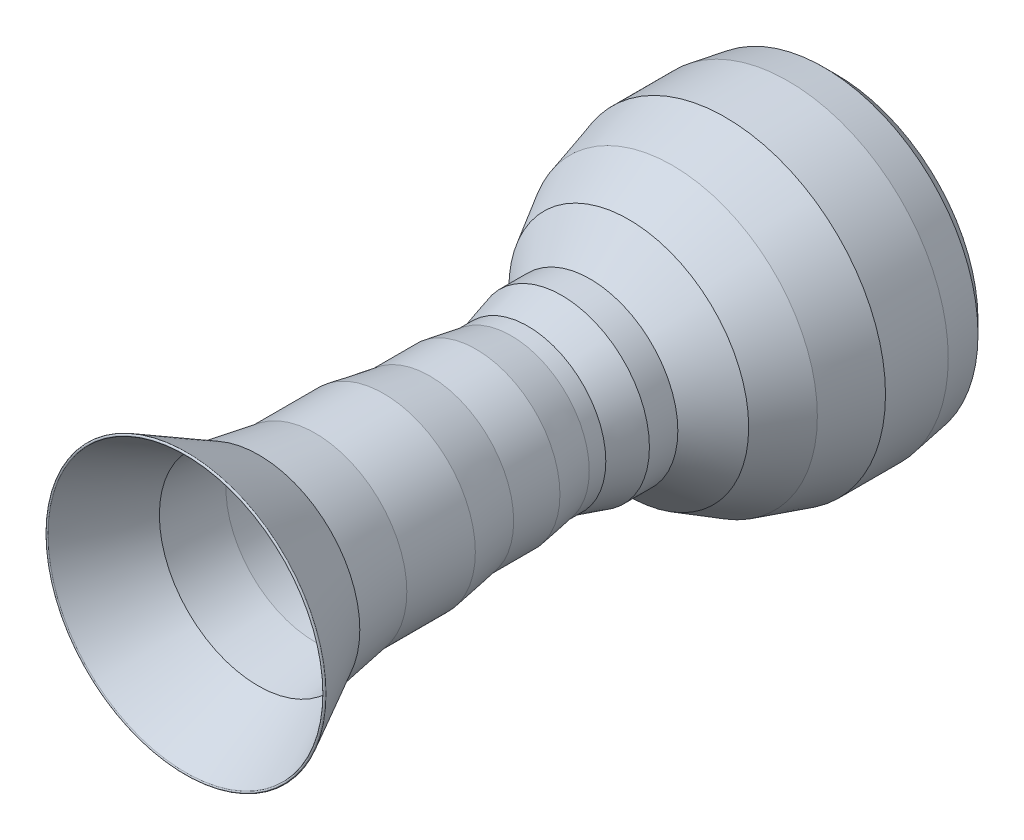
ISO-10303-21;
HEADER;
FILE_DESCRIPTION(('STEP AP214'),'2;1');
FILE_NAME('part.step','',(''),(''),'','','');
FILE_SCHEMA(('AUTOMOTIVE_DESIGN { 1 0 10303 214 1 1 1 1 }'));
ENDSEC;
DATA;
#1=APPLICATION_CONTEXT('core data for automotive mechanical design processes');
#2=APPLICATION_PROTOCOL_DEFINITION('international standard','automotive_design',2000,#1);
#3=PRODUCT_CONTEXT('',#1,'mechanical');
#4=PRODUCT('Part','Part','',(#3));
#5=PRODUCT_RELATED_PRODUCT_CATEGORY('part','',(#4));
#6=PRODUCT_DEFINITION_FORMATION('','',#4);
#7=PRODUCT_DEFINITION_CONTEXT('part definition',#1,'design');
#8=PRODUCT_DEFINITION('design','',#6,#7);
#9=PRODUCT_DEFINITION_SHAPE('','',#8);
#10=(LENGTH_UNIT() NAMED_UNIT(*) SI_UNIT(.MILLI.,.METRE.));
#11=(NAMED_UNIT(*) PLANE_ANGLE_UNIT() SI_UNIT($,.RADIAN.));
#12=(NAMED_UNIT(*) SI_UNIT($,.STERADIAN.) SOLID_ANGLE_UNIT());
#13=UNCERTAINTY_MEASURE_WITH_UNIT(LENGTH_MEASURE(1.E-05),#10,'distance_accuracy_value','');
#14=(GEOMETRIC_REPRESENTATION_CONTEXT(3) GLOBAL_UNCERTAINTY_ASSIGNED_CONTEXT((#13)) GLOBAL_UNIT_ASSIGNED_CONTEXT((#10,
#11,#12)) REPRESENTATION_CONTEXT('',''));
#15=CARTESIAN_POINT('',(0.,0.,0.));
#16=DIRECTION('',(0.,0.,1.));
#17=DIRECTION('',(1.,0.,0.));
#18=AXIS2_PLACEMENT_3D('',#15,#16,#17);
#19=CARTESIAN_POINT('',(0.,0.,-1242.65130735075));
#20=DIRECTION('',(0.,0.,1.));
#21=DIRECTION('',(1.,0.,0.));
#22=AXIS2_PLACEMENT_3D('',#19,#20,#21);
#23=TOROIDAL_SURFACE('',#22,598.951714386417,4.99999999999999);
#24=CARTESIAN_POINT('',(0.,0.,-1240.30050704522));
#25=DIRECTION('',(0.,0.,1.));
#26=DIRECTION('',(1.,0.,0.));
#27=AXIS2_PLACEMENT_3D('',#24,#25,#26);
#28=CIRCLE('',#27,594.538808549723);
#29=CARTESIAN_POINT('',(594.538808549723,0.,-1240.30050704522));
#30=VERTEX_POINT('',#29);
#31=EDGE_CURVE('E141',#30,#30,#28,.T.);
#32=ORIENTED_EDGE('',*,*,#31,.F.);
#33=EDGE_LOOP('',(#32));
#34=FACE_BOUND('',#33,.T.);
#35=CARTESIAN_POINT('',(0.,0.,-1245.00210765627));
#36=DIRECTION('',(0.,0.,1.));
#37=DIRECTION('',(1.,0.,0.));
#38=AXIS2_PLACEMENT_3D('',#35,#36,#37);
#39=CIRCLE('',#38,603.364620223111);
#40=CARTESIAN_POINT('',(603.364620223111,0.,-1245.00210765627));
#41=VERTEX_POINT('',#40);
#42=EDGE_CURVE('E10',#41,#41,#39,.T.);
#43=ORIENTED_EDGE('',*,*,#42,.T.);
#44=EDGE_LOOP('',(#43));
#45=FACE_BOUND('',#44,.T.);
#46=ADVANCED_FACE('F35',(#34,#45),#23,.T.);
#47=CARTESIAN_POINT('',(0.,0.,-1557.65293964381));
#48=DIRECTION('',(0.,0.,1.));
#49=DIRECTION('',(1.,0.,0.));
#50=AXIS2_PLACEMENT_3D('',#47,#48,#49);
#51=CONICAL_SURFACE('',#50,436.812307855919,0.48947212493324);
#52=ORIENTED_EDGE('',*,*,#42,.F.);
#53=EDGE_LOOP('',(#52));
#54=FACE_BOUND('',#53,.T.);
#55=CARTESIAN_POINT('',(0.,0.,-1557.65293964381));
#56=DIRECTION('',(0.,0.,1.));
#57=DIRECTION('',(1.,0.,0.));
#58=AXIS2_PLACEMENT_3D('',#55,#56,#57);
#59=CIRCLE('',#58,436.812307855919);
#60=CARTESIAN_POINT('',(436.812307855919,0.,-1557.65293964381));
#61=VERTEX_POINT('',#60);
#62=EDGE_CURVE('E41',#61,#61,#59,.T.);
#63=ORIENTED_EDGE('',*,*,#62,.T.);
#64=EDGE_LOOP('',(#63));
#65=FACE_BOUND('',#64,.T.);
#66=ADVANCED_FACE('F148',(#54,#65),#51,.T.);
#67=CARTESIAN_POINT('',(0.,0.,-1801.80188384453));
#68=DIRECTION('',(0.,0.,1.));
#69=DIRECTION('',(1.,0.,0.));
#70=AXIS2_PLACEMENT_3D('',#67,#68,#69);
#71=CONICAL_SURFACE('',#70,396.120817155799,0.165148677414626);
#72=ORIENTED_EDGE('',*,*,#62,.F.);
#73=EDGE_LOOP('',(#72));
#74=FACE_BOUND('',#73,.T.);
#75=CARTESIAN_POINT('',(0.,0.,-1801.80188384453));
#76=DIRECTION('',(0.,0.,1.));
#77=DIRECTION('',(1.,0.,0.));
#78=AXIS2_PLACEMENT_3D('',#75,#76,#77);
#79=CIRCLE('',#78,396.120817155799);
#80=CARTESIAN_POINT('',(396.120817155799,0.,-1801.80188384453));
#81=VERTEX_POINT('',#80);
#82=EDGE_CURVE('E45',#81,#81,#79,.T.);
#83=ORIENTED_EDGE('',*,*,#82,.T.);
#84=EDGE_LOOP('',(#83));
#85=FACE_BOUND('',#84,.T.);
#86=ADVANCED_FACE('F152',(#74,#85),#71,.T.);
#87=CARTESIAN_POINT('',(0.,0.,0.));
#88=DIRECTION('',(0.,0.,1.));
#89=DIRECTION('',(1.,0.,0.));
#90=AXIS2_PLACEMENT_3D('',#87,#88,#89);
#91=CYLINDRICAL_SURFACE('',#90,396.120817155799);
#92=ORIENTED_EDGE('',*,*,#82,.F.);
#93=EDGE_LOOP('',(#92));
#94=FACE_BOUND('',#93,.T.);
#95=CARTESIAN_POINT('',(0.,0.,-2098.28381526406));
#96=DIRECTION('',(0.,0.,1.));
#97=DIRECTION('',(1.,0.,0.));
#98=AXIS2_PLACEMENT_3D('',#95,#96,#97);
#99=CIRCLE('',#98,396.120817155799);
#100=CARTESIAN_POINT('',(396.120817155799,0.,-2098.28381526406));
#101=VERTEX_POINT('',#100);
#102=EDGE_CURVE('E49',#101,#101,#99,.T.);
#103=ORIENTED_EDGE('',*,*,#102,.T.);
#104=EDGE_LOOP('',(#103));
#105=FACE_BOUND('',#104,.T.);
#106=ADVANCED_FACE('F157',(#94,#105),#91,.T.);
#107=CARTESIAN_POINT('',(0.,0.,-2297.26071759217));
#108=DIRECTION('',(0.,0.,1.));
#109=DIRECTION('',(1.,0.,0.));
#110=AXIS2_PLACEMENT_3D('',#107,#108,#109);
#111=CONICAL_SURFACE('',#110,362.958000101113,0.165148677414626);
#112=ORIENTED_EDGE('',*,*,#102,.F.);
#113=EDGE_LOOP('',(#112));
#114=FACE_BOUND('',#113,.T.);
#115=CARTESIAN_POINT('',(0.,0.,-2297.26071759217));
#116=DIRECTION('',(0.,0.,1.));
#117=DIRECTION('',(1.,0.,0.));
#118=AXIS2_PLACEMENT_3D('',#115,#116,#117);
#119=CIRCLE('',#118,362.958000101113);
#120=CARTESIAN_POINT('',(362.958000101113,0.,-2297.26071759217));
#121=VERTEX_POINT('',#120);
#122=EDGE_CURVE('E54',#121,#121,#119,.T.);
#123=ORIENTED_EDGE('',*,*,#122,.T.);
#124=EDGE_LOOP('',(#123));
#125=FACE_BOUND('',#124,.T.);
#126=ADVANCED_FACE('F163',(#114,#125),#111,.T.);
#127=CARTESIAN_POINT('',(0.,0.,0.));
#128=DIRECTION('',(0.,0.,1.));
#129=DIRECTION('',(1.,0.,0.));
#130=AXIS2_PLACEMENT_3D('',#127,#128,#129);
#131=CYLINDRICAL_SURFACE('',#130,362.958000101113);
#132=ORIENTED_EDGE('',*,*,#122,.F.);
#133=EDGE_LOOP('',(#132));
#134=FACE_BOUND('',#133,.T.);
#135=CARTESIAN_POINT('',(0.,0.,-2497.50701004679));
#136=DIRECTION('',(0.,0.,1.));
#137=DIRECTION('',(1.,0.,0.));
#138=AXIS2_PLACEMENT_3D('',#135,#136,#137);
#139=CIRCLE('',#138,362.958000101113);
#140=CARTESIAN_POINT('',(362.958000101113,0.,-2497.50701004679));
#141=VERTEX_POINT('',#140);
#142=EDGE_CURVE('E57',#141,#141,#139,.T.);
#143=ORIENTED_EDGE('',*,*,#142,.T.);
#144=EDGE_LOOP('',(#143));
#145=FACE_BOUND('',#144,.T.);
#146=ADVANCED_FACE('F167',(#134,#145),#131,.T.);
#147=CARTESIAN_POINT('',(0.,0.,-2649.69230538102));
#148=DIRECTION('',(0.,0.,1.));
#149=DIRECTION('',(1.,0.,0.));
#150=AXIS2_PLACEMENT_3D('',#147,#148,#149);
#151=CONICAL_SURFACE('',#150,337.593784212073,0.165148677414626);
#152=ORIENTED_EDGE('',*,*,#142,.F.);
#153=EDGE_LOOP('',(#152));
#154=FACE_BOUND('',#153,.T.);
#155=CARTESIAN_POINT('',(0.,0.,-2649.69230538102));
#156=DIRECTION('',(0.,0.,1.));
#157=DIRECTION('',(1.,0.,0.));
#158=AXIS2_PLACEMENT_3D('',#155,#156,#157);
#159=CIRCLE('',#158,337.593784212073);
#160=CARTESIAN_POINT('',(337.593784212073,0.,-2649.69230538102));
#161=VERTEX_POINT('',#160);
#162=EDGE_CURVE('E60',#161,#161,#159,.T.);
#163=ORIENTED_EDGE('',*,*,#162,.T.);
#164=EDGE_LOOP('',(#163));
#165=FACE_BOUND('',#164,.T.);
#166=ADVANCED_FACE('F171',(#154,#165),#151,.T.);
#167=CARTESIAN_POINT('',(0.,0.,0.));
#168=DIRECTION('',(0.,0.,1.));
#169=DIRECTION('',(1.,0.,0.));
#170=AXIS2_PLACEMENT_3D('',#167,#168,#169);
#171=CYLINDRICAL_SURFACE('',#170,337.593784212073);
#172=ORIENTED_EDGE('',*,*,#162,.F.);
#173=EDGE_LOOP('',(#172));
#174=FACE_BOUND('',#173,.T.);
#175=CARTESIAN_POINT('',(0.,0.,-2721.30928024901));
#176=DIRECTION('',(0.,0.,1.));
#177=DIRECTION('',(1.,0.,0.));
#178=AXIS2_PLACEMENT_3D('',#175,#176,#177);
#179=CIRCLE('',#178,337.593784212073);
#180=CARTESIAN_POINT('',(337.593784212073,0.,-2721.30928024901));
#181=VERTEX_POINT('',#180);
#182=EDGE_CURVE('E63',#181,#181,#179,.T.);
#183=ORIENTED_EDGE('',*,*,#182,.T.);
#184=EDGE_LOOP('',(#183));
#185=FACE_BOUND('',#184,.T.);
#186=ADVANCED_FACE('F175',(#174,#185),#171,.T.);
#187=CARTESIAN_POINT('',(0.,0.,-2868.08251362501));
#188=DIRECTION('',(0.,0.,-1.));
#189=DIRECTION('',(-1.,0.,0.));
#190=AXIS2_PLACEMENT_3D('',#187,#188,#189);
#191=CONICAL_SURFACE('',#190,379.539408628456,0.278365261369789);
#192=ORIENTED_EDGE('',*,*,#182,.F.);
#193=EDGE_LOOP('',(#192));
#194=FACE_BOUND('',#193,.T.);
#195=CARTESIAN_POINT('',(0.,0.,-2868.08251362501));
#196=DIRECTION('',(0.,0.,1.));
#197=DIRECTION('',(1.,0.,0.));
#198=AXIS2_PLACEMENT_3D('',#195,#196,#197);
#199=CIRCLE('',#198,379.539408628456);
#200=CARTESIAN_POINT('',(379.539408628456,0.,-2868.08251362501));
#201=VERTEX_POINT('',#200);
#202=EDGE_CURVE('E66',#201,#201,#199,.T.);
#203=ORIENTED_EDGE('',*,*,#202,.T.);
#204=EDGE_LOOP('',(#203));
#205=FACE_BOUND('',#204,.T.);
#206=ADVANCED_FACE('F179',(#194,#205),#191,.T.);
#207=CARTESIAN_POINT('',(0.,0.,0.));
#208=DIRECTION('',(0.,0.,1.));
#209=DIRECTION('',(1.,0.,0.));
#210=AXIS2_PLACEMENT_3D('',#207,#208,#209);
#211=CYLINDRICAL_SURFACE('',#210,379.539408628456);
#212=ORIENTED_EDGE('',*,*,#202,.F.);
#213=EDGE_LOOP('',(#212));
#214=FACE_BOUND('',#213,.T.);
#215=CARTESIAN_POINT('',(0.,0.,-2991.03105488461));
#216=DIRECTION('',(0.,0.,1.));
#217=DIRECTION('',(1.,0.,0.));
#218=AXIS2_PLACEMENT_3D('',#215,#216,#217);
#219=CIRCLE('',#218,379.539408628456);
#220=CARTESIAN_POINT('',(379.539408628456,0.,-2991.03105488461));
#221=VERTEX_POINT('',#220);
#222=EDGE_CURVE('E69',#221,#221,#219,.T.);
#223=ORIENTED_EDGE('',*,*,#222,.T.);
#224=EDGE_LOOP('',(#223));
#225=FACE_BOUND('',#224,.T.);
#226=ADVANCED_FACE('F183',(#214,#225),#211,.T.);
#227=CARTESIAN_POINT('',(0.,379.539408628456,-2991.03105488461));
#228=DIRECTION('',(0.,0.,1.));
#229=DIRECTION('',(1.,0.,0.));
#230=AXIS2_PLACEMENT_3D('',#227,#228,#229);
#231=PLANE('',#230);
#232=ORIENTED_EDGE('',*,*,#222,.F.);
#233=EDGE_LOOP('',(#232));
#234=FACE_BOUND('',#233,.T.);
#235=CARTESIAN_POINT('',(0.,0.,-2991.03105488461));
#236=DIRECTION('',(0.,0.,1.));
#237=DIRECTION('',(1.,0.,0.));
#238=AXIS2_PLACEMENT_3D('',#235,#236,#237);
#239=CIRCLE('',#238,351.735919835804);
#240=CARTESIAN_POINT('',(351.735919835804,0.,-2991.03105488461));
#241=VERTEX_POINT('',#240);
#242=EDGE_CURVE('E72',#241,#241,#239,.T.);
#243=ORIENTED_EDGE('',*,*,#242,.T.);
#244=EDGE_LOOP('',(#243));
#245=FACE_BOUND('',#244,.T.);
#246=ADVANCED_FACE('F187',(#234,#245),#231,.F.);
#247=CARTESIAN_POINT('',(0.,0.,-3158.18359050274));
#248=DIRECTION('',(0.,0.,-1.));
#249=DIRECTION('',(-1.,0.,0.));
#250=AXIS2_PLACEMENT_3D('',#247,#248,#249);
#251=CONICAL_SURFACE('',#250,518.888455453929,0.785398163397448);
#252=ORIENTED_EDGE('',*,*,#242,.F.);
#253=EDGE_LOOP('',(#252));
#254=FACE_BOUND('',#253,.T.);
#255=CARTESIAN_POINT('',(0.,0.,-3158.18359050274));
#256=DIRECTION('',(0.,0.,1.));
#257=DIRECTION('',(1.,0.,0.));
#258=AXIS2_PLACEMENT_3D('',#255,#256,#257);
#259=CIRCLE('',#258,518.888455453929);
#260=CARTESIAN_POINT('',(518.888455453929,0.,-3158.18359050274));
#261=VERTEX_POINT('',#260);
#262=EDGE_CURVE('E75',#261,#261,#259,.T.);
#263=ORIENTED_EDGE('',*,*,#262,.T.);
#264=EDGE_LOOP('',(#263));
#265=FACE_BOUND('',#264,.T.);
#266=ADVANCED_FACE('F191',(#254,#265),#251,.T.);
#267=CARTESIAN_POINT('',(0.,0.,-3346.97824169142));
#268=DIRECTION('',(0.,0.,-1.));
#269=DIRECTION('',(-1.,0.,0.));
#270=AXIS2_PLACEMENT_3D('',#267,#268,#269);
#271=CONICAL_SURFACE('',#270,627.302210637388,0.521264185541147);
#272=ORIENTED_EDGE('',*,*,#262,.F.);
#273=EDGE_LOOP('',(#272));
#274=FACE_BOUND('',#273,.T.);
#275=CARTESIAN_POINT('',(0.,0.,-3346.97824169142));
#276=DIRECTION('',(0.,0.,1.));
#277=DIRECTION('',(1.,0.,0.));
#278=AXIS2_PLACEMENT_3D('',#275,#276,#277);
#279=CIRCLE('',#278,627.302210637388);
#280=CARTESIAN_POINT('',(627.302210637388,0.,-3346.97824169142));
#281=VERTEX_POINT('',#280);
#282=EDGE_CURVE('E78',#281,#281,#279,.T.);
#283=ORIENTED_EDGE('',*,*,#282,.T.);
#284=EDGE_LOOP('',(#283));
#285=FACE_BOUND('',#284,.T.);
#286=ADVANCED_FACE('F195',(#274,#285),#271,.T.);
#287=CARTESIAN_POINT('',(0.,0.,-3576.30083016957));
#288=DIRECTION('',(0.,0.,-1.));
#289=DIRECTION('',(-1.,0.,0.));
#290=AXIS2_PLACEMENT_3D('',#287,#288,#289);
#291=CONICAL_SURFACE('',#290,692.839222701807,0.278365261369789);
#292=ORIENTED_EDGE('',*,*,#282,.F.);
#293=EDGE_LOOP('',(#292));
#294=FACE_BOUND('',#293,.T.);
#295=CARTESIAN_POINT('',(0.,0.,-3576.30083016957));
#296=DIRECTION('',(0.,0.,1.));
#297=DIRECTION('',(1.,0.,0.));
#298=AXIS2_PLACEMENT_3D('',#295,#296,#297);
#299=CIRCLE('',#298,692.839222701807);
#300=CARTESIAN_POINT('',(692.839222701807,0.,-3576.30083016957));
#301=VERTEX_POINT('',#300);
#302=EDGE_CURVE('E81',#301,#301,#299,.T.);
#303=ORIENTED_EDGE('',*,*,#302,.T.);
#304=EDGE_LOOP('',(#303));
#305=FACE_BOUND('',#304,.T.);
#306=ADVANCED_FACE('F199',(#294,#305),#291,.T.);
#307=CARTESIAN_POINT('',(0.,0.,0.));
#308=DIRECTION('',(0.,0.,1.));
#309=DIRECTION('',(1.,0.,0.));
#310=AXIS2_PLACEMENT_3D('',#307,#308,#309);
#311=CYLINDRICAL_SURFACE('',#310,692.839222701807);
#312=ORIENTED_EDGE('',*,*,#302,.F.);
#313=EDGE_LOOP('',(#312));
#314=FACE_BOUND('',#313,.T.);
#315=CARTESIAN_POINT('',(0.,0.,-3847.82075710601));
#316=DIRECTION('',(0.,0.,1.));
#317=DIRECTION('',(1.,0.,0.));
#318=AXIS2_PLACEMENT_3D('',#315,#316,#317);
#319=CIRCLE('',#318,692.839222701807);
#320=CARTESIAN_POINT('',(692.839222701807,0.,-3847.82075710601));
#321=VERTEX_POINT('',#320);
#322=EDGE_CURVE('E84',#321,#321,#319,.T.);
#323=ORIENTED_EDGE('',*,*,#322,.T.);
#324=EDGE_LOOP('',(#323));
#325=FACE_BOUND('',#324,.T.);
#326=ADVANCED_FACE('F203',(#314,#325),#311,.T.);
#327=CARTESIAN_POINT('',(0.,0.,-4002.25924663623));
#328=DIRECTION('',(0.,0.,1.));
#329=DIRECTION('',(1.,0.,0.));
#330=AXIS2_PLACEMENT_3D('',#327,#328,#329);
#331=CONICAL_SURFACE('',#330,667.09947444677,0.165148677414633);
#332=ORIENTED_EDGE('',*,*,#322,.F.);
#333=EDGE_LOOP('',(#332));
#334=FACE_BOUND('',#333,.T.);
#335=CARTESIAN_POINT('',(0.,0.,-4002.25924663623));
#336=DIRECTION('',(0.,0.,1.));
#337=DIRECTION('',(1.,0.,0.));
#338=AXIS2_PLACEMENT_3D('',#335,#336,#337);
#339=CIRCLE('',#338,667.09947444677);
#340=CARTESIAN_POINT('',(667.09947444677,0.,-4002.25924663623));
#341=VERTEX_POINT('',#340);
#342=EDGE_CURVE('E87',#341,#341,#339,.T.);
#343=ORIENTED_EDGE('',*,*,#342,.T.);
#344=EDGE_LOOP('',(#343));
#345=FACE_BOUND('',#344,.T.);
#346=ADVANCED_FACE('F207',(#334,#345),#331,.T.);
#347=CARTESIAN_POINT('',(0.,0.,-4056.30912386255));
#348=DIRECTION('',(0.,0.,1.));
#349=DIRECTION('',(1.,0.,0.));
#350=AXIS2_PLACEMENT_3D('',#347,#348,#349);
#351=CONICAL_SURFACE('',#350,613.049597220446,0.78539816339744);
#352=ORIENTED_EDGE('',*,*,#342,.F.);
#353=EDGE_LOOP('',(#352));
#354=FACE_BOUND('',#353,.T.);
#355=CARTESIAN_POINT('',(0.,0.,-4056.30912386255));
#356=DIRECTION('',(0.,0.,1.));
#357=DIRECTION('',(1.,0.,0.));
#358=AXIS2_PLACEMENT_3D('',#355,#356,#357);
#359=CIRCLE('',#358,613.049597220446);
#360=CARTESIAN_POINT('',(613.049597220446,0.,-4056.30912386255));
#361=VERTEX_POINT('',#360);
#362=EDGE_CURVE('E90',#361,#361,#359,.T.);
#363=ORIENTED_EDGE('',*,*,#362,.T.);
#364=EDGE_LOOP('',(#363));
#365=FACE_BOUND('',#364,.T.);
#366=ADVANCED_FACE('F211',(#354,#365),#351,.T.);
#367=CARTESIAN_POINT('',(0.,0.,-4052.77358995662));
#368=DIRECTION('',(0.,0.,1.));
#369=DIRECTION('',(1.,0.,0.));
#370=AXIS2_PLACEMENT_3D('',#367,#368,#369);
#371=TOROIDAL_SURFACE('',#370,609.514063314514,4.9999999999992);
#372=ORIENTED_EDGE('',*,*,#362,.F.);
#373=EDGE_LOOP('',(#372));
#374=FACE_BOUND('',#373,.T.);
#375=CARTESIAN_POINT('',(0.,0.,-4049.23805605069));
#376=DIRECTION('',(0.,0.,1.));
#377=DIRECTION('',(1.,0.,0.));
#378=AXIS2_PLACEMENT_3D('',#375,#376,#377);
#379=CIRCLE('',#378,605.978529408581);
#380=CARTESIAN_POINT('',(605.978529408581,0.,-4049.23805605069));
#381=VERTEX_POINT('',#380);
#382=EDGE_CURVE('E93',#381,#381,#379,.T.);
#383=ORIENTED_EDGE('',*,*,#382,.T.);
#384=EDGE_LOOP('',(#383));
#385=FACE_BOUND('',#384,.T.);
#386=ADVANCED_FACE('F215',(#374,#385),#371,.T.);
#387=CARTESIAN_POINT('',(0.,0.,-3997.45420894835));
#388=DIRECTION('',(0.,0.,1.));
#389=DIRECTION('',(1.,0.,0.));
#390=AXIS2_PLACEMENT_3D('',#387,#388,#389);
#391=CONICAL_SURFACE('',#390,657.76237651092,0.78539816339742);
#392=ORIENTED_EDGE('',*,*,#382,.F.);
#393=EDGE_LOOP('',(#392));
#394=FACE_BOUND('',#393,.T.);
#395=CARTESIAN_POINT('',(0.,0.,-3997.45420894835));
#396=DIRECTION('',(0.,0.,1.));
#397=DIRECTION('',(1.,0.,0.));
#398=AXIS2_PLACEMENT_3D('',#395,#396,#397);
#399=CIRCLE('',#398,657.76237651092);
#400=CARTESIAN_POINT('',(657.76237651092,0.,-3997.45420894835));
#401=VERTEX_POINT('',#400);
#402=EDGE_CURVE('E96',#401,#401,#399,.T.);
#403=ORIENTED_EDGE('',*,*,#402,.T.);
#404=EDGE_LOOP('',(#403));
#405=FACE_BOUND('',#404,.T.);
#406=ADVANCED_FACE('F219',(#394,#405),#391,.F.);
#407=CARTESIAN_POINT('',(0.,0.,-3846.99313180303));
#408=DIRECTION('',(0.,0.,1.));
#409=DIRECTION('',(1.,0.,0.));
#410=AXIS2_PLACEMENT_3D('',#407,#408,#409);
#411=CONICAL_SURFACE('',#410,682.839222701807,0.165148677414636);
#412=ORIENTED_EDGE('',*,*,#402,.F.);
#413=EDGE_LOOP('',(#412));
#414=FACE_BOUND('',#413,.T.);
#415=CARTESIAN_POINT('',(0.,0.,-3846.99313180303));
#416=DIRECTION('',(0.,0.,1.));
#417=DIRECTION('',(1.,0.,0.));
#418=AXIS2_PLACEMENT_3D('',#415,#416,#417);
#419=CIRCLE('',#418,682.839222701807);
#420=CARTESIAN_POINT('',(682.839222701807,0.,-3846.99313180303));
#421=VERTEX_POINT('',#420);
#422=EDGE_CURVE('E99',#421,#421,#419,.T.);
#423=ORIENTED_EDGE('',*,*,#422,.T.);
#424=EDGE_LOOP('',(#423));
#425=FACE_BOUND('',#424,.T.);
#426=ADVANCED_FACE('F223',(#414,#425),#411,.F.);
#427=CARTESIAN_POINT('',(0.,0.,0.));
#428=DIRECTION('',(0.,0.,1.));
#429=DIRECTION('',(1.,0.,0.));
#430=AXIS2_PLACEMENT_3D('',#427,#428,#429);
#431=CYLINDRICAL_SURFACE('',#430,682.839222701807);
#432=ORIENTED_EDGE('',*,*,#422,.F.);
#433=EDGE_LOOP('',(#432));
#434=FACE_BOUND('',#433,.T.);
#435=CARTESIAN_POINT('',(0.,0.,-3577.70171406341));
#436=DIRECTION('',(0.,0.,1.));
#437=DIRECTION('',(1.,0.,0.));
#438=AXIS2_PLACEMENT_3D('',#435,#436,#437);
#439=CIRCLE('',#438,682.839222701807);
#440=CARTESIAN_POINT('',(682.839222701807,0.,-3577.70171406341));
#441=VERTEX_POINT('',#440);
#442=EDGE_CURVE('E102',#441,#441,#439,.T.);
#443=ORIENTED_EDGE('',*,*,#442,.T.);
#444=EDGE_LOOP('',(#443));
#445=FACE_BOUND('',#444,.T.);
#446=ADVANCED_FACE('F227',(#434,#445),#431,.F.);
#447=CARTESIAN_POINT('',(0.,0.,-3350.89960299214));
#448=DIRECTION('',(0.,0.,-1.));
#449=DIRECTION('',(-1.,0.,0.));
#450=AXIS2_PLACEMENT_3D('',#447,#448,#449);
#451=CONICAL_SURFACE('',#450,618.022525889883,0.278365261369789);
#452=ORIENTED_EDGE('',*,*,#442,.F.);
#453=EDGE_LOOP('',(#452));
#454=FACE_BOUND('',#453,.T.);
#455=CARTESIAN_POINT('',(0.,0.,-3350.89960299214));
#456=DIRECTION('',(0.,0.,1.));
#457=DIRECTION('',(1.,0.,0.));
#458=AXIS2_PLACEMENT_3D('',#455,#456,#457);
#459=CIRCLE('',#458,618.022525889883);
#460=CARTESIAN_POINT('',(618.022525889883,0.,-3350.89960299214));
#461=VERTEX_POINT('',#460);
#462=EDGE_CURVE('E105',#461,#461,#459,.T.);
#463=ORIENTED_EDGE('',*,*,#462,.T.);
#464=EDGE_LOOP('',(#463));
#465=FACE_BOUND('',#464,.T.);
#466=ADVANCED_FACE('F231',(#454,#465),#451,.F.);
#467=CARTESIAN_POINT('',(0.,0.,-3164.31533619793));
#468=DIRECTION('',(0.,0.,-1.));
#469=DIRECTION('',(-1.,0.,0.));
#470=AXIS2_PLACEMENT_3D('',#467,#468,#469);
#471=CONICAL_SURFACE('',#470,510.878065525401,0.521264185541147);
#472=ORIENTED_EDGE('',*,*,#462,.F.);
#473=EDGE_LOOP('',(#472));
#474=FACE_BOUND('',#473,.T.);
#475=CARTESIAN_POINT('',(0.,0.,-3164.31533619793));
#476=DIRECTION('',(0.,0.,1.));
#477=DIRECTION('',(1.,0.,0.));
#478=AXIS2_PLACEMENT_3D('',#475,#476,#477);
#479=CIRCLE('',#478,510.878065525401);
#480=CARTESIAN_POINT('',(510.878065525401,0.,-3164.31533619793));
#481=VERTEX_POINT('',#480);
#482=EDGE_CURVE('E108',#481,#481,#479,.T.);
#483=ORIENTED_EDGE('',*,*,#482,.T.);
#484=EDGE_LOOP('',(#483));
#485=FACE_BOUND('',#484,.T.);
#486=ADVANCED_FACE('F235',(#474,#485),#471,.F.);
#487=CARTESIAN_POINT('',(0.,0.,-2981.03105488461));
#488=DIRECTION('',(0.,0.,-1.));
#489=DIRECTION('',(-1.,0.,0.));
#490=AXIS2_PLACEMENT_3D('',#487,#488,#489);
#491=CONICAL_SURFACE('',#490,327.593784212073,0.785398163397468);
#492=ORIENTED_EDGE('',*,*,#482,.F.);
#493=EDGE_LOOP('',(#492));
#494=FACE_BOUND('',#493,.T.);
#495=CARTESIAN_POINT('',(0.,0.,-2981.03105488461));
#496=DIRECTION('',(0.,0.,1.));
#497=DIRECTION('',(1.,0.,0.));
#498=AXIS2_PLACEMENT_3D('',#495,#496,#497);
#499=CIRCLE('',#498,327.593784212073);
#500=CARTESIAN_POINT('',(327.593784212073,0.,-2981.03105488461));
#501=VERTEX_POINT('',#500);
#502=EDGE_CURVE('E111',#501,#501,#499,.T.);
#503=ORIENTED_EDGE('',*,*,#502,.T.);
#504=EDGE_LOOP('',(#503));
#505=FACE_BOUND('',#504,.T.);
#506=ADVANCED_FACE('F239',(#494,#505),#491,.F.);
#507=CARTESIAN_POINT('',(0.,369.539408628456,-2981.03105488461));
#508=DIRECTION('',(0.,0.,-1.));
#509=DIRECTION('',(-1.,0.,0.));
#510=AXIS2_PLACEMENT_3D('',#507,#508,#509);
#511=PLANE('',#510);
#512=ORIENTED_EDGE('',*,*,#502,.F.);
#513=EDGE_LOOP('',(#512));
#514=FACE_BOUND('',#513,.T.);
#515=CARTESIAN_POINT('',(0.,0.,-2981.03105488461));
#516=DIRECTION('',(0.,0.,1.));
#517=DIRECTION('',(1.,0.,0.));
#518=AXIS2_PLACEMENT_3D('',#515,#516,#517);
#519=CIRCLE('',#518,369.539408628456);
#520=CARTESIAN_POINT('',(369.539408628456,0.,-2981.03105488461));
#521=VERTEX_POINT('',#520);
#522=EDGE_CURVE('E114',#521,#521,#519,.T.);
#523=ORIENTED_EDGE('',*,*,#522,.T.);
#524=EDGE_LOOP('',(#523));
#525=FACE_BOUND('',#524,.T.);
#526=ADVANCED_FACE('F243',(#514,#525),#511,.F.);
#527=CARTESIAN_POINT('',(0.,0.,0.));
#528=DIRECTION('',(0.,0.,1.));
#529=DIRECTION('',(1.,0.,0.));
#530=AXIS2_PLACEMENT_3D('',#527,#528,#529);
#531=CYLINDRICAL_SURFACE('',#530,369.539408628456);
#532=ORIENTED_EDGE('',*,*,#522,.F.);
#533=EDGE_LOOP('',(#532));
#534=FACE_BOUND('',#533,.T.);
#535=CARTESIAN_POINT('',(0.,0.,-2869.48339751885));
#536=DIRECTION('',(0.,0.,1.));
#537=DIRECTION('',(1.,0.,0.));
#538=AXIS2_PLACEMENT_3D('',#535,#536,#537);
#539=CIRCLE('',#538,369.539408628456);
#540=CARTESIAN_POINT('',(369.539408628456,0.,-2869.48339751885));
#541=VERTEX_POINT('',#540);
#542=EDGE_CURVE('E117',#541,#541,#539,.T.);
#543=ORIENTED_EDGE('',*,*,#542,.T.);
#544=EDGE_LOOP('',(#543));
#545=FACE_BOUND('',#544,.T.);
#546=ADVANCED_FACE('F247',(#534,#545),#531,.F.);
#547=CARTESIAN_POINT('',(0.,0.,-2722.71016414285));
#548=DIRECTION('',(0.,0.,-1.));
#549=DIRECTION('',(-1.,0.,0.));
#550=AXIS2_PLACEMENT_3D('',#547,#548,#549);
#551=CONICAL_SURFACE('',#550,327.593784212073,0.278365261369789);
#552=ORIENTED_EDGE('',*,*,#542,.F.);
#553=EDGE_LOOP('',(#552));
#554=FACE_BOUND('',#553,.T.);
#555=CARTESIAN_POINT('',(0.,0.,-2722.71016414285));
#556=DIRECTION('',(0.,0.,1.));
#557=DIRECTION('',(1.,0.,0.));
#558=AXIS2_PLACEMENT_3D('',#555,#556,#557);
#559=CIRCLE('',#558,327.593784212073);
#560=CARTESIAN_POINT('',(327.593784212073,0.,-2722.71016414285));
#561=VERTEX_POINT('',#560);
#562=EDGE_CURVE('E120',#561,#561,#559,.T.);
#563=ORIENTED_EDGE('',*,*,#562,.T.);
#564=EDGE_LOOP('',(#563));
#565=FACE_BOUND('',#564,.T.);
#566=ADVANCED_FACE('F251',(#554,#565),#551,.F.);
#567=CARTESIAN_POINT('',(0.,0.,0.));
#568=DIRECTION('',(0.,0.,1.));
#569=DIRECTION('',(1.,0.,0.));
#570=AXIS2_PLACEMENT_3D('',#567,#568,#569);
#571=CYLINDRICAL_SURFACE('',#570,327.593784212073);
#572=ORIENTED_EDGE('',*,*,#562,.F.);
#573=EDGE_LOOP('',(#572));
#574=FACE_BOUND('',#573,.T.);
#575=CARTESIAN_POINT('',(0.,0.,-2648.86468007804));
#576=DIRECTION('',(0.,0.,1.));
#577=DIRECTION('',(1.,0.,0.));
#578=AXIS2_PLACEMENT_3D('',#575,#576,#577);
#579=CIRCLE('',#578,327.593784212073);
#580=CARTESIAN_POINT('',(327.593784212073,0.,-2648.86468007804));
#581=VERTEX_POINT('',#580);
#582=EDGE_CURVE('E123',#581,#581,#579,.T.);
#583=ORIENTED_EDGE('',*,*,#582,.T.);
#584=EDGE_LOOP('',(#583));
#585=FACE_BOUND('',#584,.T.);
#586=ADVANCED_FACE('F255',(#574,#585),#571,.F.);
#587=CARTESIAN_POINT('',(0.,0.,-2496.6793847438));
#588=DIRECTION('',(0.,0.,1.));
#589=DIRECTION('',(1.,0.,0.));
#590=AXIS2_PLACEMENT_3D('',#587,#588,#589);
#591=CONICAL_SURFACE('',#590,352.958000101113,0.165148677414626);
#592=ORIENTED_EDGE('',*,*,#582,.F.);
#593=EDGE_LOOP('',(#592));
#594=FACE_BOUND('',#593,.T.);
#595=CARTESIAN_POINT('',(0.,0.,-2496.6793847438));
#596=DIRECTION('',(0.,0.,1.));
#597=DIRECTION('',(1.,0.,0.));
#598=AXIS2_PLACEMENT_3D('',#595,#596,#597);
#599=CIRCLE('',#598,352.958000101113);
#600=CARTESIAN_POINT('',(352.958000101113,0.,-2496.6793847438));
#601=VERTEX_POINT('',#600);
#602=EDGE_CURVE('E126',#601,#601,#599,.T.);
#603=ORIENTED_EDGE('',*,*,#602,.T.);
#604=EDGE_LOOP('',(#603));
#605=FACE_BOUND('',#604,.T.);
#606=ADVANCED_FACE('F259',(#594,#605),#591,.F.);
#607=CARTESIAN_POINT('',(0.,0.,0.));
#608=DIRECTION('',(0.,0.,1.));
#609=DIRECTION('',(1.,0.,0.));
#610=AXIS2_PLACEMENT_3D('',#607,#608,#609);
#611=CYLINDRICAL_SURFACE('',#610,352.958000101113);
#612=ORIENTED_EDGE('',*,*,#602,.F.);
#613=EDGE_LOOP('',(#612));
#614=FACE_BOUND('',#613,.T.);
#615=CARTESIAN_POINT('',(0.,0.,-2296.43309228919));
#616=DIRECTION('',(0.,0.,1.));
#617=DIRECTION('',(1.,0.,0.));
#618=AXIS2_PLACEMENT_3D('',#615,#616,#617);
#619=CIRCLE('',#618,352.958000101113);
#620=CARTESIAN_POINT('',(352.958000101113,0.,-2296.43309228919));
#621=VERTEX_POINT('',#620);
#622=EDGE_CURVE('E129',#621,#621,#619,.T.);
#623=ORIENTED_EDGE('',*,*,#622,.T.);
#624=EDGE_LOOP('',(#623));
#625=FACE_BOUND('',#624,.T.);
#626=ADVANCED_FACE('F263',(#614,#625),#611,.F.);
#627=CARTESIAN_POINT('',(0.,0.,-2097.45618996108));
#628=DIRECTION('',(0.,0.,1.));
#629=DIRECTION('',(1.,0.,0.));
#630=AXIS2_PLACEMENT_3D('',#627,#628,#629);
#631=CONICAL_SURFACE('',#630,386.120817155799,0.165148677414626);
#632=ORIENTED_EDGE('',*,*,#622,.F.);
#633=EDGE_LOOP('',(#632));
#634=FACE_BOUND('',#633,.T.);
#635=CARTESIAN_POINT('',(0.,0.,-2097.45618996108));
#636=DIRECTION('',(0.,0.,1.));
#637=DIRECTION('',(1.,0.,0.));
#638=AXIS2_PLACEMENT_3D('',#635,#636,#637);
#639=CIRCLE('',#638,386.120817155799);
#640=CARTESIAN_POINT('',(386.120817155799,0.,-2097.45618996108));
#641=VERTEX_POINT('',#640);
#642=EDGE_CURVE('E132',#641,#641,#639,.T.);
#643=ORIENTED_EDGE('',*,*,#642,.T.);
#644=EDGE_LOOP('',(#643));
#645=FACE_BOUND('',#644,.T.);
#646=ADVANCED_FACE('F267',(#634,#645),#631,.F.);
#647=CARTESIAN_POINT('',(0.,0.,0.));
#648=DIRECTION('',(0.,0.,1.));
#649=DIRECTION('',(1.,0.,0.));
#650=AXIS2_PLACEMENT_3D('',#647,#648,#649);
#651=CYLINDRICAL_SURFACE('',#650,386.120817155799);
#652=ORIENTED_EDGE('',*,*,#642,.F.);
#653=EDGE_LOOP('',(#652));
#654=FACE_BOUND('',#653,.T.);
#655=CARTESIAN_POINT('',(0.,0.,-1800.97425854155));
#656=DIRECTION('',(0.,0.,1.));
#657=DIRECTION('',(1.,0.,0.));
#658=AXIS2_PLACEMENT_3D('',#655,#656,#657);
#659=CIRCLE('',#658,386.120817155799);
#660=CARTESIAN_POINT('',(386.120817155799,0.,-1800.97425854155));
#661=VERTEX_POINT('',#660);
#662=EDGE_CURVE('E135',#661,#661,#659,.T.);
#663=ORIENTED_EDGE('',*,*,#662,.T.);
#664=EDGE_LOOP('',(#663));
#665=FACE_BOUND('',#664,.T.);
#666=ADVANCED_FACE('F271',(#654,#665),#651,.F.);
#667=CARTESIAN_POINT('',(0.,0.,-1554.39522646986));
#668=DIRECTION('',(0.,0.,1.));
#669=DIRECTION('',(1.,0.,0.));
#670=AXIS2_PLACEMENT_3D('',#667,#668,#669);
#671=CONICAL_SURFACE('',#670,427.217322501079,0.165148677414626);
#672=ORIENTED_EDGE('',*,*,#662,.F.);
#673=EDGE_LOOP('',(#672));
#674=FACE_BOUND('',#673,.T.);
#675=CARTESIAN_POINT('',(0.,0.,-1554.39522646986));
#676=DIRECTION('',(0.,0.,1.));
#677=DIRECTION('',(1.,0.,0.));
#678=AXIS2_PLACEMENT_3D('',#675,#676,#677);
#679=CIRCLE('',#678,427.217322501079);
#680=CARTESIAN_POINT('',(427.217322501079,0.,-1554.39522646986));
#681=VERTEX_POINT('',#680);
#682=EDGE_CURVE('E138',#681,#681,#679,.T.);
#683=ORIENTED_EDGE('',*,*,#682,.T.);
#684=EDGE_LOOP('',(#683));
#685=FACE_BOUND('',#684,.T.);
#686=ADVANCED_FACE('F275',(#674,#685),#671,.F.);
#687=CARTESIAN_POINT('',(0.,0.,-1240.30050704522));
#688=DIRECTION('',(0.,0.,1.));
#689=DIRECTION('',(1.,0.,0.));
#690=AXIS2_PLACEMENT_3D('',#687,#688,#689);
#691=CONICAL_SURFACE('',#690,594.538808549723,0.48947212493324);
#692=ORIENTED_EDGE('',*,*,#682,.F.);
#693=EDGE_LOOP('',(#692));
#694=FACE_BOUND('',#693,.T.);
#695=ORIENTED_EDGE('',*,*,#31,.T.);
#696=EDGE_LOOP('',(#695));
#697=FACE_BOUND('',#696,.T.);
#698=ADVANCED_FACE('F145',(#694,#697),#691,.F.);
#699=CLOSED_SHELL('',(#46,#66,#86,#106,#126,#146,#166,#186,#206,#226,#246,#266,#286,#306,#326,
#346,#366,#386,#406,#426,#446,#466,#486,#506,#526,#546,#566,#586,#606,#626,#646,#666,#686,#698));
#700=MANIFOLD_SOLID_BREP('B2',#699);
#701=ADVANCED_BREP_SHAPE_REPRESENTATION('',(#18,#700),#14);
#702=SHAPE_DEFINITION_REPRESENTATION(#9,#701);
ENDSEC;
END-ISO-10303-21;
